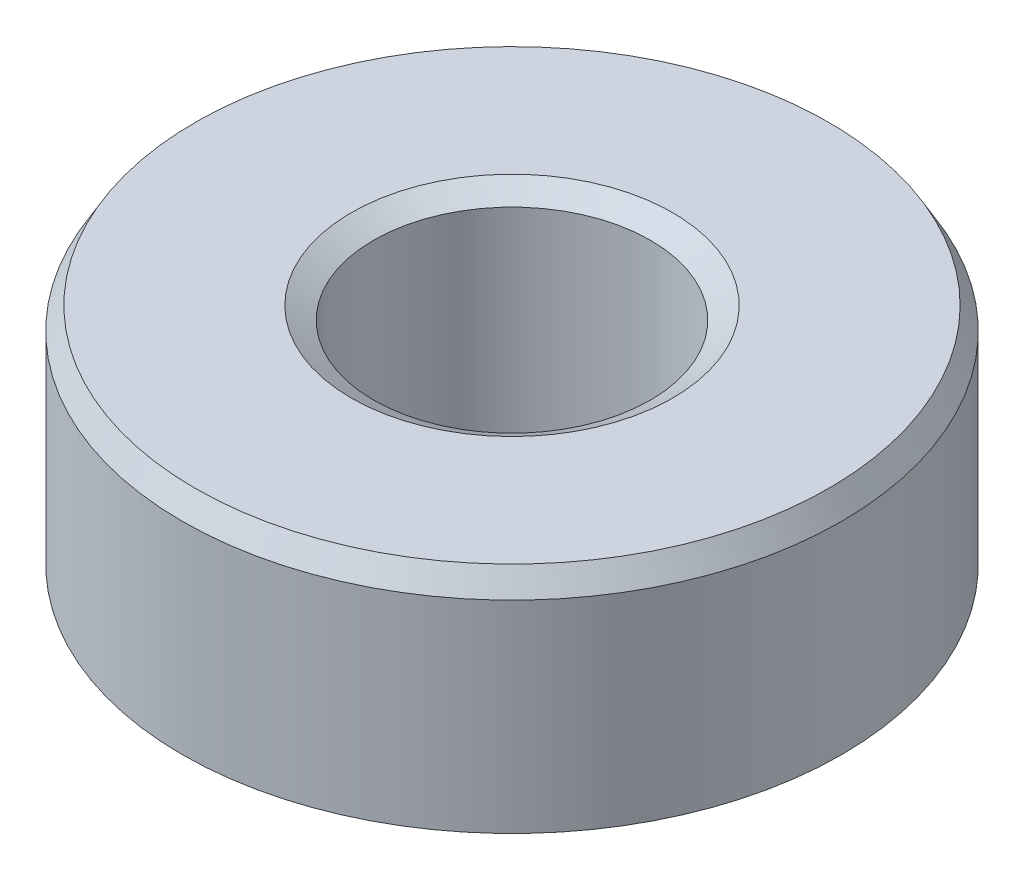
ISO-10303-21;
HEADER;
FILE_DESCRIPTION(('STEP AP214'),'2;1');
FILE_NAME('part.step','',(''),(''),'','','');
FILE_SCHEMA(('AUTOMOTIVE_DESIGN { 1 0 10303 214 1 1 1 1 }'));
ENDSEC;
DATA;
#1=APPLICATION_CONTEXT('core data for automotive mechanical design processes');
#2=APPLICATION_PROTOCOL_DEFINITION('international standard','automotive_design',2000,#1);
#3=PRODUCT_CONTEXT('',#1,'mechanical');
#4=PRODUCT('Part','Part','',(#3));
#5=PRODUCT_RELATED_PRODUCT_CATEGORY('part','',(#4));
#6=PRODUCT_DEFINITION_FORMATION('','',#4);
#7=PRODUCT_DEFINITION_CONTEXT('part definition',#1,'design');
#8=PRODUCT_DEFINITION('design','',#6,#7);
#9=PRODUCT_DEFINITION_SHAPE('','',#8);
#10=(LENGTH_UNIT() NAMED_UNIT(*) SI_UNIT(.MILLI.,.METRE.));
#11=(NAMED_UNIT(*) PLANE_ANGLE_UNIT() SI_UNIT($,.RADIAN.));
#12=(NAMED_UNIT(*) SI_UNIT($,.STERADIAN.) SOLID_ANGLE_UNIT());
#13=UNCERTAINTY_MEASURE_WITH_UNIT(LENGTH_MEASURE(1.E-05),#10,'distance_accuracy_value','');
#14=(GEOMETRIC_REPRESENTATION_CONTEXT(3) GLOBAL_UNCERTAINTY_ASSIGNED_CONTEXT((#13)) GLOBAL_UNIT_ASSIGNED_CONTEXT((#10,
#11,#12)) REPRESENTATION_CONTEXT('',''));
#15=CARTESIAN_POINT('',(0.,0.,0.));
#16=DIRECTION('',(0.,0.,1.));
#17=DIRECTION('',(1.,0.,0.));
#18=AXIS2_PLACEMENT_3D('',#15,#16,#17);
#19=CARTESIAN_POINT('',(0.,35.954805003662,0.));
#20=DIRECTION('',(0.,-1.,0.));
#21=DIRECTION('',(0.,0.,-1.));
#22=AXIS2_PLACEMENT_3D('',#19,#20,#21);
#23=CYLINDRICAL_SURFACE('',#22,50.);
#24=CARTESIAN_POINT('',(0.,1.94305983593038,0.));
#25=DIRECTION('',(0.,1.,0.));
#26=DIRECTION('',(0.,0.,1.));
#27=AXIS2_PLACEMENT_3D('',#24,#25,#26);
#28=CIRCLE('',#27,50.);
#29=CARTESIAN_POINT('',(0.,1.94305983593038,50.));
#30=VERTEX_POINT('',#29);
#31=EDGE_CURVE('E10',#30,#30,#28,.T.);
#32=ORIENTED_EDGE('',*,*,#31,.T.);
#33=EDGE_LOOP('',(#32));
#34=FACE_BOUND('',#33,.T.);
#35=CARTESIAN_POINT('',(0.,32.5893266456841,0.));
#36=DIRECTION('',(0.,1.,0.));
#37=DIRECTION('',(0.,0.,1.));
#38=AXIS2_PLACEMENT_3D('',#35,#36,#37);
#39=CIRCLE('',#38,50.);
#40=CARTESIAN_POINT('',(0.,32.5893266456841,50.));
#41=VERTEX_POINT('',#40);
#42=EDGE_CURVE('E50',#41,#41,#39,.F.);
#43=ORIENTED_EDGE('',*,*,#42,.T.);
#44=EDGE_LOOP('',(#43));
#45=FACE_BOUND('',#44,.T.);
#46=ADVANCED_FACE('F39',(#34,#45),#23,.T.);
#47=CARTESIAN_POINT('',(0.,35.954805003662,0.));
#48=DIRECTION('',(0.,1.,0.));
#49=DIRECTION('',(0.,0.,1.));
#50=AXIS2_PLACEMENT_3D('',#47,#48,#49);
#51=PLANE('',#50);
#52=CARTESIAN_POINT('',(0.,35.954805003662,0.));
#53=DIRECTION('',(0.,1.,0.));
#54=DIRECTION('',(0.,0.,1.));
#55=AXIS2_PLACEMENT_3D('',#52,#53,#54);
#56=CIRCLE('',#55,24.3646346722447);
#57=CARTESIAN_POINT('',(0.,35.954805003662,24.3646346722447));
#58=VERTEX_POINT('',#57);
#59=EDGE_CURVE('E58',#58,#58,#56,.F.);
#60=ORIENTED_EDGE('',*,*,#59,.T.);
#61=EDGE_LOOP('',(#60));
#62=FACE_BOUND('',#61,.T.);
#63=CARTESIAN_POINT('',(0.,35.954805003662,0.));
#64=DIRECTION('',(0.,1.,0.));
#65=DIRECTION('',(0.,0.,1.));
#66=AXIS2_PLACEMENT_3D('',#63,#64,#65);
#67=CIRCLE('',#66,48.0569401640696);
#68=CARTESIAN_POINT('',(0.,35.954805003662,48.0569401640696));
#69=VERTEX_POINT('',#68);
#70=EDGE_CURVE('E61',#69,#69,#67,.T.);
#71=ORIENTED_EDGE('',*,*,#70,.T.);
#72=EDGE_LOOP('',(#71));
#73=FACE_BOUND('',#72,.T.);
#74=ADVANCED_FACE('F88',(#62,#73),#51,.T.);
#75=CARTESIAN_POINT('',(0.,0.,0.));
#76=DIRECTION('',(0.,1.,0.));
#77=DIRECTION('',(0.,0.,1.));
#78=AXIS2_PLACEMENT_3D('',#75,#76,#77);
#79=PLANE('',#78);
#80=CARTESIAN_POINT('',(0.,0.,0.));
#81=DIRECTION('',(0.,1.,0.));
#82=DIRECTION('',(0.,0.,1.));
#83=AXIS2_PLACEMENT_3D('',#80,#81,#82);
#84=CIRCLE('',#83,22.9422161501971);
#85=CARTESIAN_POINT('',(0.,0.,22.9422161501971));
#86=VERTEX_POINT('',#85);
#87=EDGE_CURVE('E51',#86,#86,#84,.T.);
#88=ORIENTED_EDGE('',*,*,#87,.T.);
#89=EDGE_LOOP('',(#88));
#90=FACE_BOUND('',#89,.T.);
#91=CARTESIAN_POINT('',(0.,0.,0.));
#92=DIRECTION('',(0.,1.,0.));
#93=DIRECTION('',(0.,0.,1.));
#94=AXIS2_PLACEMENT_3D('',#91,#92,#93);
#95=CIRCLE('',#94,46.6345216420221);
#96=CARTESIAN_POINT('',(0.,0.,46.6345216420221));
#97=VERTEX_POINT('',#96);
#98=EDGE_CURVE('E54',#97,#97,#95,.F.);
#99=ORIENTED_EDGE('',*,*,#98,.T.);
#100=EDGE_LOOP('',(#99));
#101=FACE_BOUND('',#100,.T.);
#102=ADVANCED_FACE('F83',(#90,#101),#79,.F.);
#103=CARTESIAN_POINT('',(0.,35.954805003662,0.));
#104=DIRECTION('',(0.,-1.,0.));
#105=DIRECTION('',(0.,0.,-1.));
#106=AXIS2_PLACEMENT_3D('',#103,#104,#105);
#107=CYLINDRICAL_SURFACE('',#106,20.9991563142668);
#108=CARTESIAN_POINT('',(0.,34.0117451677316,0.));
#109=DIRECTION('',(0.,1.,0.));
#110=DIRECTION('',(0.,0.,1.));
#111=AXIS2_PLACEMENT_3D('',#108,#109,#110);
#112=CIRCLE('',#111,20.9991563142668);
#113=CARTESIAN_POINT('',(0.,34.0117451677316,20.9991563142668));
#114=VERTEX_POINT('',#113);
#115=EDGE_CURVE('E67',#114,#114,#112,.T.);
#116=ORIENTED_EDGE('',*,*,#115,.T.);
#117=EDGE_LOOP('',(#116));
#118=FACE_BOUND('',#117,.T.);
#119=CARTESIAN_POINT('',(0.,3.36547835797787,0.));
#120=DIRECTION('',(0.,1.,0.));
#121=DIRECTION('',(0.,0.,1.));
#122=AXIS2_PLACEMENT_3D('',#119,#120,#121);
#123=CIRCLE('',#122,20.9991563142668);
#124=CARTESIAN_POINT('',(0.,3.36547835797787,20.9991563142668));
#125=VERTEX_POINT('',#124);
#126=EDGE_CURVE('E69',#125,#125,#123,.F.);
#127=ORIENTED_EDGE('',*,*,#126,.T.);
#128=EDGE_LOOP('',(#127));
#129=FACE_BOUND('',#128,.T.);
#130=ADVANCED_FACE('F71',(#118,#129),#107,.F.);
#131=CARTESIAN_POINT('',(0.,34.0117451677316,0.));
#132=DIRECTION('',(0.,1.,0.));
#133=DIRECTION('',(0.,0.,1.));
#134=AXIS2_PLACEMENT_3D('',#131,#132,#133);
#135=CONICAL_SURFACE('',#134,20.9991563142668,1.0471975511966);
#136=ORIENTED_EDGE('',*,*,#59,.F.);
#137=EDGE_LOOP('',(#136));
#138=FACE_BOUND('',#137,.T.);
#139=ORIENTED_EDGE('',*,*,#115,.F.);
#140=EDGE_LOOP('',(#139));
#141=FACE_BOUND('',#140,.T.);
#142=ADVANCED_FACE('F77',(#138,#141),#135,.F.);
#143=CARTESIAN_POINT('',(0.,0.,0.));
#144=DIRECTION('',(0.,-1.,0.));
#145=DIRECTION('',(0.,0.,-1.));
#146=AXIS2_PLACEMENT_3D('',#143,#144,#145);
#147=CONICAL_SURFACE('',#146,22.9422161501971,0.523598775598295);
#148=ORIENTED_EDGE('',*,*,#126,.F.);
#149=EDGE_LOOP('',(#148));
#150=FACE_BOUND('',#149,.T.);
#151=ORIENTED_EDGE('',*,*,#87,.F.);
#152=EDGE_LOOP('',(#151));
#153=FACE_BOUND('',#152,.T.);
#154=ADVANCED_FACE('F73',(#150,#153),#147,.F.);
#155=CARTESIAN_POINT('',(0.,1.94305983593038,0.));
#156=DIRECTION('',(0.,1.,0.));
#157=DIRECTION('',(0.,0.,1.));
#158=AXIS2_PLACEMENT_3D('',#155,#156,#157);
#159=CONICAL_SURFACE('',#158,50.,1.0471975511966);
#160=ORIENTED_EDGE('',*,*,#98,.F.);
#161=EDGE_LOOP('',(#160));
#162=FACE_BOUND('',#161,.T.);
#163=ORIENTED_EDGE('',*,*,#31,.F.);
#164=EDGE_LOOP('',(#163));
#165=FACE_BOUND('',#164,.T.);
#166=ADVANCED_FACE('F76',(#162,#165),#159,.T.);
#167=CARTESIAN_POINT('',(0.,35.954805003662,0.));
#168=DIRECTION('',(0.,-1.,0.));
#169=DIRECTION('',(0.,0.,-1.));
#170=AXIS2_PLACEMENT_3D('',#167,#168,#169);
#171=CONICAL_SURFACE('',#170,48.0569401640696,0.523598775598296);
#172=ORIENTED_EDGE('',*,*,#42,.F.);
#173=EDGE_LOOP('',(#172));
#174=FACE_BOUND('',#173,.T.);
#175=ORIENTED_EDGE('',*,*,#70,.F.);
#176=EDGE_LOOP('',(#175));
#177=FACE_BOUND('',#176,.T.);
#178=ADVANCED_FACE('F45',(#174,#177),#171,.T.);
#179=CLOSED_SHELL('',(#46,#74,#102,#130,#142,#154,#166,#178));
#180=MANIFOLD_SOLID_BREP('B2',#179);
#181=ADVANCED_BREP_SHAPE_REPRESENTATION('',(#18,#180),#14);
#182=SHAPE_DEFINITION_REPRESENTATION(#9,#181);
ENDSEC;
END-ISO-10303-21;
